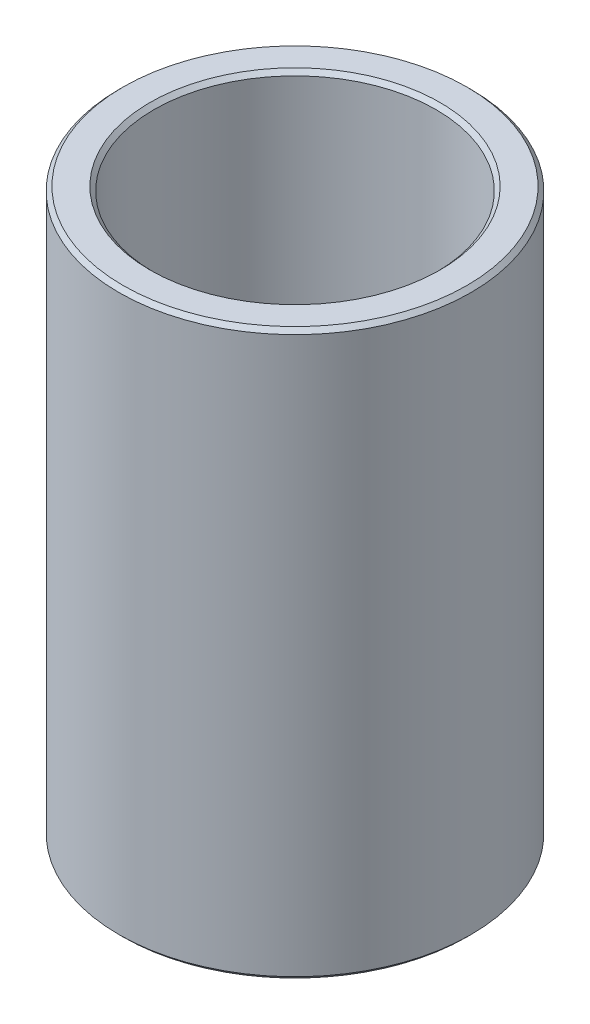
ISO-10303-21;
HEADER;
FILE_DESCRIPTION(('STEP AP214'),'2;1');
FILE_NAME('part.step','',(''),(''),'','','');
FILE_SCHEMA(('AUTOMOTIVE_DESIGN { 1 0 10303 214 1 1 1 1 }'));
ENDSEC;
DATA;
#1=APPLICATION_CONTEXT('core data for automotive mechanical design processes');
#2=APPLICATION_PROTOCOL_DEFINITION('international standard','automotive_design',2000,#1);
#3=PRODUCT_CONTEXT('',#1,'mechanical');
#4=PRODUCT('Part','Part','',(#3));
#5=PRODUCT_RELATED_PRODUCT_CATEGORY('part','',(#4));
#6=PRODUCT_DEFINITION_FORMATION('','',#4);
#7=PRODUCT_DEFINITION_CONTEXT('part definition',#1,'design');
#8=PRODUCT_DEFINITION('design','',#6,#7);
#9=PRODUCT_DEFINITION_SHAPE('','',#8);
#10=(LENGTH_UNIT() NAMED_UNIT(*) SI_UNIT(.MILLI.,.METRE.));
#11=(NAMED_UNIT(*) PLANE_ANGLE_UNIT() SI_UNIT($,.RADIAN.));
#12=(NAMED_UNIT(*) SI_UNIT($,.STERADIAN.) SOLID_ANGLE_UNIT());
#13=UNCERTAINTY_MEASURE_WITH_UNIT(LENGTH_MEASURE(1.E-05),#10,'distance_accuracy_value','');
#14=(GEOMETRIC_REPRESENTATION_CONTEXT(3) GLOBAL_UNCERTAINTY_ASSIGNED_CONTEXT((#13)) GLOBAL_UNIT_ASSIGNED_CONTEXT((#10,
#11,#12)) REPRESENTATION_CONTEXT('',''));
#15=CARTESIAN_POINT('',(0.,0.,0.));
#16=DIRECTION('',(0.,0.,1.));
#17=DIRECTION('',(1.,0.,0.));
#18=AXIS2_PLACEMENT_3D('',#15,#16,#17);
#19=CARTESIAN_POINT('',(0.,104.1880727642,0.));
#20=DIRECTION('',(0.,-1.,0.));
#21=DIRECTION('',(0.,0.,-1.));
#22=AXIS2_PLACEMENT_3D('',#19,#20,#21);
#23=CYLINDRICAL_SURFACE('',#22,32.5);
#24=CARTESIAN_POINT('',(0.,0.755256746545419,0.));
#25=DIRECTION('',(0.,1.,0.));
#26=DIRECTION('',(0.,0.,1.));
#27=AXIS2_PLACEMENT_3D('',#24,#25,#26);
#28=CIRCLE('',#27,32.5);
#29=CARTESIAN_POINT('',(0.,0.755256746545419,-32.5));
#30=VERTEX_POINT('',#29);
#31=EDGE_CURVE('E10',#30,#30,#28,.T.);
#32=CARTESIAN_POINT('',(0.,103.432816017654,0.));
#33=DIRECTION('',(0.,1.,0.));
#34=DIRECTION('',(0.,0.,1.));
#35=AXIS2_PLACEMENT_3D('',#32,#33,#34);
#36=CIRCLE('',#35,32.5);
#37=CARTESIAN_POINT('',(0.,103.432816017654,-32.5));
#38=VERTEX_POINT('',#37);
#39=EDGE_CURVE('E50',#38,#38,#36,.F.);
#40=CARTESIAN_POINT('',(0.,0.755256746545419,-32.5));
#41=CARTESIAN_POINT('',(0.,1.82481465561947,-32.5));
#42=CARTESIAN_POINT('',(0.,2.89437256469352,-32.5));
#43=CARTESIAN_POINT('',(0.,5.03348838284162,-32.5));
#44=CARTESIAN_POINT('',(0.,6.10304629191567,-32.5));
#45=CARTESIAN_POINT('',(0.,8.24216211006378,-32.5));
#46=CARTESIAN_POINT('',(0.,9.31172001913783,-32.5));
#47=CARTESIAN_POINT('',(0.,11.4508358372859,-32.5));
#48=CARTESIAN_POINT('',(0.,12.52039374636,-32.5));
#49=CARTESIAN_POINT('',(0.,14.6595095645081,-32.5));
#50=CARTESIAN_POINT('',(0.,15.7290674735821,-32.5));
#51=CARTESIAN_POINT('',(0.,17.8681832917302,-32.5));
#52=CARTESIAN_POINT('',(0.,18.9377412008043,-32.5));
#53=CARTESIAN_POINT('',(0.,21.0768570189524,-32.5));
#54=CARTESIAN_POINT('',(0.,22.1464149280264,-32.5));
#55=CARTESIAN_POINT('',(0.,24.2855307461745,-32.5));
#56=CARTESIAN_POINT('',(0.,25.3550886552486,-32.5));
#57=CARTESIAN_POINT('',(0.,27.4942044733967,-32.5));
#58=CARTESIAN_POINT('',(0.,28.5637623824707,-32.5));
#59=CARTESIAN_POINT('',(0.,30.7028782006188,-32.5));
#60=CARTESIAN_POINT('',(0.,31.7724361096929,-32.5));
#61=CARTESIAN_POINT('',(0.,33.911551927841,-32.5));
#62=CARTESIAN_POINT('',(0.,34.981109836915,-32.5));
#63=CARTESIAN_POINT('',(0.,37.1202256550631,-32.5));
#64=CARTESIAN_POINT('',(0.,38.1897835641372,-32.5));
#65=CARTESIAN_POINT('',(0.,40.3288993822853,-32.5));
#66=CARTESIAN_POINT('',(0.,41.3984572913593,-32.5));
#67=CARTESIAN_POINT('',(0.,43.5375731095074,-32.5));
#68=CARTESIAN_POINT('',(0.,44.6071310185815,-32.5));
#69=CARTESIAN_POINT('',(0.,46.7462468367296,-32.5));
#70=CARTESIAN_POINT('',(0.,47.8158047458036,-32.5));
#71=CARTESIAN_POINT('',(0.,49.9549205639517,-32.5));
#72=CARTESIAN_POINT('',(0.,51.0244784730258,-32.5));
#73=CARTESIAN_POINT('',(0.,53.1635942911739,-32.5));
#74=CARTESIAN_POINT('',(0.,54.2331522002479,-32.5));
#75=CARTESIAN_POINT('',(0.,56.372268018396,-32.5));
#76=CARTESIAN_POINT('',(0.,57.4418259274701,-32.5));
#77=CARTESIAN_POINT('',(0.,59.5809417456182,-32.5));
#78=CARTESIAN_POINT('',(0.,60.6504996546922,-32.5));
#79=CARTESIAN_POINT('',(0.,62.7896154728403,-32.5));
#80=CARTESIAN_POINT('',(0.,63.8591733819144,-32.5));
#81=CARTESIAN_POINT('',(0.,65.9982892000625,-32.5));
#82=CARTESIAN_POINT('',(0.,67.0678471091365,-32.5));
#83=CARTESIAN_POINT('',(0.,69.2069629272846,-32.5));
#84=CARTESIAN_POINT('',(0.,70.2765208363587,-32.5));
#85=CARTESIAN_POINT('',(0.,72.4156366545068,-32.5));
#86=CARTESIAN_POINT('',(0.,73.4851945635808,-32.5));
#87=CARTESIAN_POINT('',(0.,75.6243103817289,-32.5));
#88=CARTESIAN_POINT('',(0.,76.693868290803,-32.5));
#89=CARTESIAN_POINT('',(0.,78.8329841089511,-32.5));
#90=CARTESIAN_POINT('',(0.,79.9025420180251,-32.5));
#91=CARTESIAN_POINT('',(0.,82.0416578361732,-32.5));
#92=CARTESIAN_POINT('',(0.,83.1112157452473,-32.5));
#93=CARTESIAN_POINT('',(0.,85.2503315633954,-32.5));
#94=CARTESIAN_POINT('',(0.,86.3198894724695,-32.5));
#95=CARTESIAN_POINT('',(0.,88.4590052906176,-32.5));
#96=CARTESIAN_POINT('',(0.,89.5285631996916,-32.5));
#97=CARTESIAN_POINT('',(0.,91.6676790178397,-32.5));
#98=CARTESIAN_POINT('',(0.,92.7372369269137,-32.5));
#99=CARTESIAN_POINT('',(0.,94.8763527450618,-32.5));
#100=CARTESIAN_POINT('',(0.,95.9459106541359,-32.5));
#101=CARTESIAN_POINT('',(0.,98.085026472284,-32.5));
#102=CARTESIAN_POINT('',(0.,99.154584381358,-32.5));
#103=CARTESIAN_POINT('',(0.,101.293700199506,-32.5));
#104=CARTESIAN_POINT('',(0.,102.36325810858,-32.5));
#105=CARTESIAN_POINT('',(0.,103.432816017654,-32.5));
#106=B_SPLINE_CURVE_WITH_KNOTS('',3,(#40,#41,#42,#43,#44,#45,#46,#47,#48,#49,#50,#51,#52,#53,
#54,#55,#56,#57,#58,#59,#60,#61,#62,#63,#64,#65,#66,#67,#68,#69,#70,#71,#72,#73,#74,#75,#76,#77,
#78,#79,#80,#81,#82,#83,#84,#85,#86,#87,#88,#89,#90,#91,#92,#93,#94,#95,#96,#97,#98,#99,#100,
#101,#102,#103,#104,#105),.UNSPECIFIED.,.F.,.F.,(4,2,2,2,2,2,2,2,2,2,2,2,2,2,2,2,2,2,2,2,2,2,2,
2,2,2,2,2,2,2,2,2,4),(0.,3.20867372722215,6.41734745444431,9.62602118166646,12.8346949088886,
16.0433686361107,19.2520423633329,22.4607160905551,25.6693898177772,28.8780635449994,
32.0867372722215,35.2954109994437,38.5040847266658,41.712758453888,44.9214321811101,
48.1301059083323,51.3387796355544,54.5474533627766,57.7561270899987,60.9648008172209,
64.173474544443,67.3821482716652,70.5908219988873,73.7994957261095,77.0081694533316,
80.2168431805538,83.4255169077759,86.6341906349981,89.8428643622202,93.0515380894424,
96.2602118166645,99.4688855438867,102.677559271109),.UNSPECIFIED.);
#107=EDGE_CURVE('BSEAM39',#30,#38,#106,.T.);
#108=ORIENTED_EDGE('',*,*,#31,.T.);
#109=ORIENTED_EDGE('',*,*,#39,.T.);
#110=ORIENTED_EDGE('',*,*,#107,.T.);
#111=ORIENTED_EDGE('',*,*,#107,.F.);
#112=EDGE_LOOP('',(#108,#110,#109,#111));
#113=FACE_BOUND('',#112,.T.);
#114=ADVANCED_FACE('F39',(#113),#23,.T.);
#115=CARTESIAN_POINT('',(0.,104.1880727642,0.));
#116=DIRECTION('',(0.,1.,0.));
#117=DIRECTION('',(0.,0.,1.));
#118=AXIS2_PLACEMENT_3D('',#115,#116,#117);
#119=PLANE('',#118);
#120=CARTESIAN_POINT('',(0.,104.1880727642,0.));
#121=DIRECTION('',(0.,1.,0.));
#122=DIRECTION('',(0.,0.,1.));
#123=AXIS2_PLACEMENT_3D('',#120,#121,#122);
#124=CIRCLE('',#123,26.7918937358219);
#125=CARTESIAN_POINT('',(0.,104.1880727642,26.7918937358219));
#126=VERTEX_POINT('',#125);
#127=EDGE_CURVE('E58',#126,#126,#124,.F.);
#128=ORIENTED_EDGE('',*,*,#127,.T.);
#129=EDGE_LOOP('',(#128));
#130=FACE_BOUND('',#129,.T.);
#131=CARTESIAN_POINT('',(0.,104.1880727642,0.));
#132=DIRECTION('',(0.,1.,0.));
#133=DIRECTION('',(0.,0.,1.));
#134=AXIS2_PLACEMENT_3D('',#131,#132,#133);
#135=CIRCLE('',#134,31.7447432534545);
#136=CARTESIAN_POINT('',(0.,104.1880727642,-31.7447432534545));
#137=VERTEX_POINT('',#136);
#138=EDGE_CURVE('E61',#137,#137,#135,.T.);
#139=ORIENTED_EDGE('',*,*,#138,.T.);
#140=EDGE_LOOP('',(#139));
#141=FACE_BOUND('',#140,.T.);
#142=ADVANCED_FACE('F88',(#130,#141),#119,.T.);
#143=CARTESIAN_POINT('',(0.,0.,0.));
#144=DIRECTION('',(0.,1.,0.));
#145=DIRECTION('',(0.,0.,1.));
#146=AXIS2_PLACEMENT_3D('',#143,#144,#145);
#147=PLANE('',#146);
#148=CARTESIAN_POINT('',(0.,0.,0.));
#149=DIRECTION('',(0.,1.,0.));
#150=DIRECTION('',(0.,0.,1.));
#151=AXIS2_PLACEMENT_3D('',#148,#149,#150);
#152=CIRCLE('',#151,26.7918937358219);
#153=CARTESIAN_POINT('',(0.,0.,-26.7918937358219));
#154=VERTEX_POINT('',#153);
#155=EDGE_CURVE('E51',#154,#154,#152,.T.);
#156=ORIENTED_EDGE('',*,*,#155,.T.);
#157=EDGE_LOOP('',(#156));
#158=FACE_BOUND('',#157,.T.);
#159=CARTESIAN_POINT('',(0.,0.,0.));
#160=DIRECTION('',(0.,1.,0.));
#161=DIRECTION('',(0.,0.,1.));
#162=AXIS2_PLACEMENT_3D('',#159,#160,#161);
#163=CIRCLE('',#162,31.7447432534546);
#164=CARTESIAN_POINT('',(0.,0.,31.7447432534546));
#165=VERTEX_POINT('',#164);
#166=EDGE_CURVE('E54',#165,#165,#163,.F.);
#167=ORIENTED_EDGE('',*,*,#166,.T.);
#168=EDGE_LOOP('',(#167));
#169=FACE_BOUND('',#168,.T.);
#170=ADVANCED_FACE('F83',(#158,#169),#147,.F.);
#171=CARTESIAN_POINT('',(0.,104.1880727642,0.));
#172=DIRECTION('',(0.,-1.,0.));
#173=DIRECTION('',(0.,0.,-1.));
#174=AXIS2_PLACEMENT_3D('',#171,#172,#173);
#175=CYLINDRICAL_SURFACE('',#174,26.0366369892765);
#176=CARTESIAN_POINT('',(0.,103.432816017654,0.));
#177=DIRECTION('',(0.,1.,0.));
#178=DIRECTION('',(0.,0.,1.));
#179=AXIS2_PLACEMENT_3D('',#176,#177,#178);
#180=CIRCLE('',#179,26.0366369892765);
#181=CARTESIAN_POINT('',(0.,103.432816017654,-26.0366369892765));
#182=VERTEX_POINT('',#181);
#183=EDGE_CURVE('E67',#182,#182,#180,.T.);
#184=CARTESIAN_POINT('',(0.,0.755256746545432,0.));
#185=DIRECTION('',(0.,1.,0.));
#186=DIRECTION('',(0.,0.,1.));
#187=AXIS2_PLACEMENT_3D('',#184,#185,#186);
#188=CIRCLE('',#187,26.0366369892765);
#189=CARTESIAN_POINT('',(0.,0.755256746545419,-26.0366369892765));
#190=VERTEX_POINT('',#189);
#191=EDGE_CURVE('E69',#190,#190,#188,.F.);
#192=CARTESIAN_POINT('',(0.,103.432816017654,-26.0366369892765));
#193=CARTESIAN_POINT('',(0.,102.36325810858,-26.0366369892765));
#194=CARTESIAN_POINT('',(0.,101.293700199506,-26.0366369892765));
#195=CARTESIAN_POINT('',(0.,99.1545843813581,-26.0366369892765));
#196=CARTESIAN_POINT('',(0.,98.0850264722841,-26.0366369892765));
#197=CARTESIAN_POINT('',(0.,95.945910654136,-26.0366369892765));
#198=CARTESIAN_POINT('',(0.,94.8763527450619,-26.0366369892765));
#199=CARTESIAN_POINT('',(0.,92.7372369269138,-26.0366369892765));
#200=CARTESIAN_POINT('',(0.,91.6676790178398,-26.0366369892765));
#201=CARTESIAN_POINT('',(0.,89.5285631996917,-26.0366369892765));
#202=CARTESIAN_POINT('',(0.,88.4590052906176,-26.0366369892765));
#203=CARTESIAN_POINT('',(0.,86.3198894724695,-26.0366369892765));
#204=CARTESIAN_POINT('',(0.,85.2503315633955,-26.0366369892765));
#205=CARTESIAN_POINT('',(0.,83.1112157452474,-26.0366369892765));
#206=CARTESIAN_POINT('',(0.,82.0416578361733,-26.0366369892765));
#207=CARTESIAN_POINT('',(0.,79.9025420180252,-26.0366369892765));
#208=CARTESIAN_POINT('',(0.,78.8329841089512,-26.0366369892765));
#209=CARTESIAN_POINT('',(0.,76.6938682908031,-26.0366369892765));
#210=CARTESIAN_POINT('',(0.,75.624310381729,-26.0366369892765));
#211=CARTESIAN_POINT('',(0.,73.4851945635809,-26.0366369892765));
#212=CARTESIAN_POINT('',(0.,72.4156366545069,-26.0366369892765));
#213=CARTESIAN_POINT('',(0.,70.2765208363588,-26.0366369892765));
#214=CARTESIAN_POINT('',(0.,69.2069629272847,-26.0366369892765));
#215=CARTESIAN_POINT('',(0.,67.0678471091366,-26.0366369892765));
#216=CARTESIAN_POINT('',(0.,65.9982892000626,-26.0366369892765));
#217=CARTESIAN_POINT('',(0.,63.8591733819145,-26.0366369892765));
#218=CARTESIAN_POINT('',(0.,62.7896154728404,-26.0366369892765));
#219=CARTESIAN_POINT('',(0.,60.6504996546923,-26.0366369892765));
#220=CARTESIAN_POINT('',(0.,59.5809417456182,-26.0366369892765));
#221=CARTESIAN_POINT('',(0.,57.4418259274701,-26.0366369892765));
#222=CARTESIAN_POINT('',(0.,56.3722680183961,-26.0366369892765));
#223=CARTESIAN_POINT('',(0.,54.233152200248,-26.0366369892765));
#224=CARTESIAN_POINT('',(0.,53.1635942911739,-26.0366369892765));
#225=CARTESIAN_POINT('',(0.,51.0244784730258,-26.0366369892765));
#226=CARTESIAN_POINT('',(0.,49.9549205639518,-26.0366369892765));
#227=CARTESIAN_POINT('',(0.,47.8158047458037,-26.0366369892765));
#228=CARTESIAN_POINT('',(0.,46.7462468367296,-26.0366369892765));
#229=CARTESIAN_POINT('',(0.,44.6071310185815,-26.0366369892765));
#230=CARTESIAN_POINT('',(0.,43.5375731095075,-26.0366369892765));
#231=CARTESIAN_POINT('',(0.,41.3984572913594,-26.0366369892765));
#232=CARTESIAN_POINT('',(0.,40.3288993822853,-26.0366369892765));
#233=CARTESIAN_POINT('',(0.,38.1897835641372,-26.0366369892765));
#234=CARTESIAN_POINT('',(0.,37.1202256550632,-26.0366369892765));
#235=CARTESIAN_POINT('',(0.,34.9811098369151,-26.0366369892765));
#236=CARTESIAN_POINT('',(0.,33.911551927841,-26.0366369892765));
#237=CARTESIAN_POINT('',(0.,31.7724361096929,-26.0366369892765));
#238=CARTESIAN_POINT('',(0.,30.7028782006189,-26.0366369892765));
#239=CARTESIAN_POINT('',(0.,28.5637623824708,-26.0366369892765));
#240=CARTESIAN_POINT('',(0.,27.4942044733967,-26.0366369892765));
#241=CARTESIAN_POINT('',(0.,25.3550886552486,-26.0366369892765));
#242=CARTESIAN_POINT('',(0.,24.2855307461745,-26.0366369892765));
#243=CARTESIAN_POINT('',(0.,22.1464149280264,-26.0366369892765));
#244=CARTESIAN_POINT('',(0.,21.0768570189524,-26.0366369892765));
#245=CARTESIAN_POINT('',(0.,18.9377412008043,-26.0366369892765));
#246=CARTESIAN_POINT('',(0.,17.8681832917302,-26.0366369892765));
#247=CARTESIAN_POINT('',(0.,15.7290674735821,-26.0366369892765));
#248=CARTESIAN_POINT('',(0.,14.6595095645081,-26.0366369892765));
#249=CARTESIAN_POINT('',(0.,12.52039374636,-26.0366369892765));
#250=CARTESIAN_POINT('',(0.,11.4508358372859,-26.0366369892765));
#251=CARTESIAN_POINT('',(0.,9.31172001913783,-26.0366369892765));
#252=CARTESIAN_POINT('',(0.,8.24216211006378,-26.0366369892765));
#253=CARTESIAN_POINT('',(0.,6.10304629191568,-26.0366369892765));
#254=CARTESIAN_POINT('',(0.,5.03348838284163,-26.0366369892765));
#255=CARTESIAN_POINT('',(0.,2.89437256469353,-26.0366369892765));
#256=CARTESIAN_POINT('',(0.,1.82481465561947,-26.0366369892765));
#257=CARTESIAN_POINT('',(0.,0.755256746545419,-26.0366369892765));
#258=B_SPLINE_CURVE_WITH_KNOTS('',3,(#192,#193,#194,#195,#196,#197,#198,#199,#200,#201,#202,
#203,#204,#205,#206,#207,#208,#209,#210,#211,#212,#213,#214,#215,#216,#217,#218,#219,#220,#221,
#222,#223,#224,#225,#226,#227,#228,#229,#230,#231,#232,#233,#234,#235,#236,#237,#238,#239,#240,
#241,#242,#243,#244,#245,#246,#247,#248,#249,#250,#251,#252,#253,#254,#255,#256,#257),
.UNSPECIFIED.,.F.,.F.,(4,2,2,2,2,2,2,2,2,2,2,2,2,2,2,2,2,2,2,2,2,2,2,2,2,2,2,2,2,2,2,2,4),(0.,
3.20867372722215,6.41734745444431,9.62602118166646,12.8346949088886,16.0433686361108,
19.2520423633329,22.4607160905551,25.6693898177772,28.8780635449994,32.0867372722215,
35.2954109994437,38.5040847266658,41.712758453888,44.9214321811101,48.1301059083323,
51.3387796355545,54.5474533627766,57.7561270899988,60.9648008172209,64.1734745444431,
67.3821482716652,70.5908219988874,73.7994957261095,77.0081694533317,80.2168431805538,
83.425516907776,86.6341906349981,89.8428643622203,93.0515380894424,96.2602118166646,
99.4688855438867,102.677559271109),.UNSPECIFIED.);
#259=EDGE_CURVE('BSEAM71',#182,#190,#258,.T.);
#260=ORIENTED_EDGE('',*,*,#183,.T.);
#261=ORIENTED_EDGE('',*,*,#191,.T.);
#262=ORIENTED_EDGE('',*,*,#259,.T.);
#263=ORIENTED_EDGE('',*,*,#259,.F.);
#264=EDGE_LOOP('',(#260,#262,#261,#263));
#265=FACE_BOUND('',#264,.T.);
#266=ADVANCED_FACE('F71',(#265),#175,.F.);
#267=CARTESIAN_POINT('',(0.,103.432816017654,0.));
#268=DIRECTION('',(0.,1.,0.));
#269=DIRECTION('',(0.,0.,1.));
#270=AXIS2_PLACEMENT_3D('',#267,#268,#269);
#271=CONICAL_SURFACE('',#270,26.0366369892765,0.785398163397451);
#272=ORIENTED_EDGE('',*,*,#127,.F.);
#273=EDGE_LOOP('',(#272));
#274=FACE_BOUND('',#273,.T.);
#275=ORIENTED_EDGE('',*,*,#183,.F.);
#276=EDGE_LOOP('',(#275));
#277=FACE_BOUND('',#276,.T.);
#278=ADVANCED_FACE('F77',(#274,#277),#271,.F.);
#279=CARTESIAN_POINT('',(0.,0.,0.));
#280=DIRECTION('',(0.,-1.,0.));
#281=DIRECTION('',(0.,0.,-1.));
#282=AXIS2_PLACEMENT_3D('',#279,#280,#281);
#283=CONICAL_SURFACE('',#282,26.7918937358219,0.785398163397441);
#284=CARTESIAN_POINT('',(0.,0.755256746545432,-26.0366369892765));
#285=CARTESIAN_POINT('',(0.,0.747389488768917,-26.044504247053));
#286=CARTESIAN_POINT('',(0.,0.739522230992402,-26.0523715048295));
#287=CARTESIAN_POINT('',(0.,0.723787715439373,-26.0681060203825));
#288=CARTESIAN_POINT('',(0.,0.715920457662858,-26.075973278159));
#289=CARTESIAN_POINT('',(0.,0.700185942109828,-26.0917077937121));
#290=CARTESIAN_POINT('',(0.,0.692318684333313,-26.0995750514886));
#291=CARTESIAN_POINT('',(0.,0.676584168780283,-26.1153095670416));
#292=CARTESIAN_POINT('',(0.,0.668716911003768,-26.1231768248181));
#293=CARTESIAN_POINT('',(0.,0.652982395450738,-26.1389113403711));
#294=CARTESIAN_POINT('',(0.,0.645115137674223,-26.1467785981477));
#295=CARTESIAN_POINT('',(0.,0.629380622121194,-26.1625131137007));
#296=CARTESIAN_POINT('',(0.,0.621513364344679,-26.1703803714772));
#297=CARTESIAN_POINT('',(0.,0.605778848791649,-26.1861148870302));
#298=CARTESIAN_POINT('',(0.,0.597911591015134,-26.1939821448067));
#299=CARTESIAN_POINT('',(0.,0.582177075462104,-26.2097166603598));
#300=CARTESIAN_POINT('',(0.,0.574309817685589,-26.2175839181363));
#301=CARTESIAN_POINT('',(0.,0.558575302132559,-26.2333184336893));
#302=CARTESIAN_POINT('',(0.,0.550708044356044,-26.2411856914658));
#303=CARTESIAN_POINT('',(0.,0.534973528803015,-26.2569202070189));
#304=CARTESIAN_POINT('',(0.,0.5271062710265,-26.2647874647954));
#305=CARTESIAN_POINT('',(0.,0.51137175547347,-26.2805219803484));
#306=CARTESIAN_POINT('',(0.,0.503504497696955,-26.2883892381249));
#307=CARTESIAN_POINT('',(0.,0.487769982143925,-26.304123753678));
#308=CARTESIAN_POINT('',(0.,0.47990272436741,-26.3119910114545));
#309=CARTESIAN_POINT('',(0.,0.46416820881438,-26.3277255270075));
#310=CARTESIAN_POINT('',(0.,0.456300951037865,-26.335592784784));
#311=CARTESIAN_POINT('',(0.,0.440566435484836,-26.351327300337));
#312=CARTESIAN_POINT('',(0.,0.432699177708321,-26.3591945581136));
#313=CARTESIAN_POINT('',(0.,0.416964662155291,-26.3749290736666));
#314=CARTESIAN_POINT('',(0.,0.409097404378775,-26.3827963314431));
#315=CARTESIAN_POINT('',(0.,0.393362888825746,-26.3985308469961));
#316=CARTESIAN_POINT('',(0.,0.385495631049231,-26.4063981047726));
#317=CARTESIAN_POINT('',(0.,0.369761115496202,-26.4221326203257));
#318=CARTESIAN_POINT('',(0.,0.361893857719686,-26.4299998781022));
#319=CARTESIAN_POINT('',(0.,0.346159342166656,-26.4457343936552));
#320=CARTESIAN_POINT('',(0.,0.338292084390141,-26.4536016514317));
#321=CARTESIAN_POINT('',(0.,0.322557568837112,-26.4693361669848));
#322=CARTESIAN_POINT('',(0.,0.314690311060597,-26.4772034247613));
#323=CARTESIAN_POINT('',(0.,0.298955795507567,-26.4929379403143));
#324=CARTESIAN_POINT('',(0.,0.291088537731052,-26.5008051980908));
#325=CARTESIAN_POINT('',(0.,0.275354022178022,-26.5165397136439));
#326=CARTESIAN_POINT('',(0.,0.267486764401507,-26.5244069714204));
#327=CARTESIAN_POINT('',(0.,0.251752248848477,-26.5401414869734));
#328=CARTESIAN_POINT('',(0.,0.243884991071963,-26.5480087447499));
#329=CARTESIAN_POINT('',(0.,0.228150475518933,-26.5637432603029));
#330=CARTESIAN_POINT('',(0.,0.220283217742418,-26.5716105180795));
#331=CARTESIAN_POINT('',(0.,0.204548702189388,-26.5873450336325));
#332=CARTESIAN_POINT('',(0.,0.196681444412873,-26.595212291409));
#333=CARTESIAN_POINT('',(0.,0.180946928859843,-26.610946806962));
#334=CARTESIAN_POINT('',(0.,0.173079671083328,-26.6188140647385));
#335=CARTESIAN_POINT('',(0.,0.157345155530298,-26.6345485802916));
#336=CARTESIAN_POINT('',(0.,0.149477897753783,-26.6424158380681));
#337=CARTESIAN_POINT('',(0.,0.133743382200754,-26.6581503536211));
#338=CARTESIAN_POINT('',(0.,0.125876124424239,-26.6660176113976));
#339=CARTESIAN_POINT('',(0.,0.110141608871209,-26.6817521269507));
#340=CARTESIAN_POINT('',(0.,0.102274351094694,-26.6896193847272));
#341=CARTESIAN_POINT('',(0.,0.0865398355416641,-26.7053539002802));
#342=CARTESIAN_POINT('',(0.,0.0786725777651492,-26.7132211580567));
#343=CARTESIAN_POINT('',(0.,0.0629380622121194,-26.7289556736098));
#344=CARTESIAN_POINT('',(0.,0.0550708044356044,-26.7368229313863));
#345=CARTESIAN_POINT('',(0.,0.0393362888825746,-26.7525574469393));
#346=CARTESIAN_POINT('',(0.,0.0314690311060597,-26.7604247047158));
#347=CARTESIAN_POINT('',(0.,0.0157345155530298,-26.7761592202688));
#348=CARTESIAN_POINT('',(0.,0.00786725777651493,-26.7840264780454));
#349=CARTESIAN_POINT('',(0.,0.,-26.7918937358219));
#350=B_SPLINE_CURVE_WITH_KNOTS('',3,(#284,#285,#286,#287,#288,#289,#290,#291,#292,#293,#294,
#295,#296,#297,#298,#299,#300,#301,#302,#303,#304,#305,#306,#307,#308,#309,#310,#311,#312,#313,
#314,#315,#316,#317,#318,#319,#320,#321,#322,#323,#324,#325,#326,#327,#328,#329,#330,#331,#332,
#333,#334,#335,#336,#337,#338,#339,#340,#341,#342,#343,#344,#345,#346,#347,#348,#349),
.UNSPECIFIED.,.F.,.F.,(4,2,2,2,2,2,2,2,2,2,2,2,2,2,2,2,2,2,2,2,2,2,2,2,2,2,2,2,2,2,2,2,4),(0.,
0.0333779479386975,0.066755895877395,0.100133843816092,0.13351179175479,0.166889739693487,
0.200267687632185,0.233645635570882,0.26702358350958,0.300401531448277,0.333779479386975,
0.367157427325672,0.40053537526437,0.433913323203067,0.467291271141765,0.500669219080462,
0.534047167019162,0.56742511495786,0.600803062896557,0.634181010835255,0.667558958773952,
0.70093690671265,0.734314854651347,0.767692802590045,0.801070750528742,0.83444869846744,
0.867826646406137,0.901204594344835,0.934582542283532,0.96796049022223,1.00133843816093,
1.03471638609962,1.06809433403832),.UNSPECIFIED.);
#351=EDGE_CURVE('BSEAM73',#190,#154,#350,.T.);
#352=ORIENTED_EDGE('',*,*,#191,.F.);
#353=ORIENTED_EDGE('',*,*,#155,.F.);
#354=ORIENTED_EDGE('',*,*,#351,.T.);
#355=ORIENTED_EDGE('',*,*,#351,.F.);
#356=EDGE_LOOP('',(#352,#354,#353,#355));
#357=FACE_BOUND('',#356,.T.);
#358=ADVANCED_FACE('F73',(#357),#283,.F.);
#359=CARTESIAN_POINT('',(0.,0.755256746545419,0.));
#360=DIRECTION('',(0.,1.,0.));
#361=DIRECTION('',(0.,0.,1.));
#362=AXIS2_PLACEMENT_3D('',#359,#360,#361);
#363=CONICAL_SURFACE('',#362,32.5,0.785398163397457);
#364=ORIENTED_EDGE('',*,*,#166,.F.);
#365=EDGE_LOOP('',(#364));
#366=FACE_BOUND('',#365,.T.);
#367=ORIENTED_EDGE('',*,*,#31,.F.);
#368=EDGE_LOOP('',(#367));
#369=FACE_BOUND('',#368,.T.);
#370=ADVANCED_FACE('F76',(#366,#369),#363,.T.);
#371=CARTESIAN_POINT('',(0.,104.1880727642,0.));
#372=DIRECTION('',(0.,-1.,0.));
#373=DIRECTION('',(0.,0.,-1.));
#374=AXIS2_PLACEMENT_3D('',#371,#372,#373);
#375=CONICAL_SURFACE('',#374,31.7447432534545,0.785398163397439);
#376=CARTESIAN_POINT('',(0.,103.432816017654,-32.5));
#377=CARTESIAN_POINT('',(0.,103.440683275431,-32.4921327422235));
#378=CARTESIAN_POINT('',(0.,103.448550533207,-32.484265484447));
#379=CARTESIAN_POINT('',(0.,103.46428504876,-32.4685309688939));
#380=CARTESIAN_POINT('',(0.,103.472152306537,-32.4606637111174));
#381=CARTESIAN_POINT('',(0.,103.48788682209,-32.4449291955644));
#382=CARTESIAN_POINT('',(0.,103.495754079866,-32.4370619377879));
#383=CARTESIAN_POINT('',(0.,103.511488595419,-32.4213274222349));
#384=CARTESIAN_POINT('',(0.,103.519355853196,-32.4134601644583));
#385=CARTESIAN_POINT('',(0.,103.535090368749,-32.3977256489053));
#386=CARTESIAN_POINT('',(0.,103.542957626525,-32.3898583911288));
#387=CARTESIAN_POINT('',(0.,103.558692142079,-32.3741238755758));
#388=CARTESIAN_POINT('',(0.,103.566559399855,-32.3662566177993));
#389=CARTESIAN_POINT('',(0.,103.582293915408,-32.3505221022462));
#390=CARTESIAN_POINT('',(0.,103.590161173185,-32.3426548444697));
#391=CARTESIAN_POINT('',(0.,103.605895688738,-32.3269203289167));
#392=CARTESIAN_POINT('',(0.,103.613762946514,-32.3190530711402));
#393=CARTESIAN_POINT('',(0.,103.629497462067,-32.3033185555871));
#394=CARTESIAN_POINT('',(0.,103.637364719844,-32.2954512978106));
#395=CARTESIAN_POINT('',(0.,103.653099235397,-32.2797167822576));
#396=CARTESIAN_POINT('',(0.,103.660966493173,-32.2718495244811));
#397=CARTESIAN_POINT('',(0.,103.676701008726,-32.256115008928));
#398=CARTESIAN_POINT('',(0.,103.684568266503,-32.2482477511515));
#399=CARTESIAN_POINT('',(0.,103.700302782056,-32.2325132355985));
#400=CARTESIAN_POINT('',(0.,103.708170039832,-32.224645977822));
#401=CARTESIAN_POINT('',(0.,103.723904555385,-32.2089114622689));
#402=CARTESIAN_POINT('',(0.,103.731771813162,-32.2010442044924));
#403=CARTESIAN_POINT('',(0.,103.747506328715,-32.1853096889394));
#404=CARTESIAN_POINT('',(0.,103.755373586491,-32.1774424311629));
#405=CARTESIAN_POINT('',(0.,103.771108102044,-32.1617079156099));
#406=CARTESIAN_POINT('',(0.,103.778975359821,-32.1538406578333));
#407=CARTESIAN_POINT('',(0.,103.794709875374,-32.1381061422803));
#408=CARTESIAN_POINT('',(0.,103.80257713315,-32.1302388845038));
#409=CARTESIAN_POINT('',(0.,103.818311648704,-32.1145043689508));
#410=CARTESIAN_POINT('',(0.,103.82617890648,-32.1066371111742));
#411=CARTESIAN_POINT('',(0.,103.841913422033,-32.0909025956212));
#412=CARTESIAN_POINT('',(0.,103.84978067981,-32.0830353378447));
#413=CARTESIAN_POINT('',(0.,103.865515195363,-32.0673008222917));
#414=CARTESIAN_POINT('',(0.,103.873382453139,-32.0594335645151));
#415=CARTESIAN_POINT('',(0.,103.889116968692,-32.0436990489621));
#416=CARTESIAN_POINT('',(0.,103.896984226469,-32.0358317911856));
#417=CARTESIAN_POINT('',(0.,103.912718742022,-32.0200972756326));
#418=CARTESIAN_POINT('',(0.,103.920585999798,-32.0122300178561));
#419=CARTESIAN_POINT('',(0.,103.936320515351,-31.996495502303));
#420=CARTESIAN_POINT('',(0.,103.944187773128,-31.9886282445265));
#421=CARTESIAN_POINT('',(0.,103.959922288681,-31.9728937289735));
#422=CARTESIAN_POINT('',(0.,103.967789546457,-31.965026471197));
#423=CARTESIAN_POINT('',(0.,103.98352406201,-31.9492919556439));
#424=CARTESIAN_POINT('',(0.,103.991391319787,-31.9414246978674));
#425=CARTESIAN_POINT('',(0.,104.00712583534,-31.9256901823144));
#426=CARTESIAN_POINT('',(0.,104.014993093116,-31.9178229245379));
#427=CARTESIAN_POINT('',(0.,104.030727608669,-31.9020884089848));
#428=CARTESIAN_POINT('',(0.,104.038594866446,-31.8942211512083));
#429=CARTESIAN_POINT('',(0.,104.054329381999,-31.8784866356553));
#430=CARTESIAN_POINT('',(0.,104.062196639775,-31.8706193778788));
#431=CARTESIAN_POINT('',(0.,104.077931155329,-31.8548848623257));
#432=CARTESIAN_POINT('',(0.,104.085798413105,-31.8470176045492));
#433=CARTESIAN_POINT('',(0.,104.101532928658,-31.8312830889962));
#434=CARTESIAN_POINT('',(0.,104.109400186435,-31.8234158312197));
#435=CARTESIAN_POINT('',(0.,104.125134701988,-31.8076813156667));
#436=CARTESIAN_POINT('',(0.,104.133001959764,-31.7998140578901));
#437=CARTESIAN_POINT('',(0.,104.148736475317,-31.7840795423371));
#438=CARTESIAN_POINT('',(0.,104.156603733094,-31.7762122845606));
#439=CARTESIAN_POINT('',(0.,104.172338248647,-31.7604777690076));
#440=CARTESIAN_POINT('',(0.,104.180205506423,-31.7526105112311));
#441=CARTESIAN_POINT('',(0.,104.1880727642,-31.7447432534545));
#442=B_SPLINE_CURVE_WITH_KNOTS('',3,(#376,#377,#378,#379,#380,#381,#382,#383,#384,#385,#386,
#387,#388,#389,#390,#391,#392,#393,#394,#395,#396,#397,#398,#399,#400,#401,#402,#403,#404,#405,
#406,#407,#408,#409,#410,#411,#412,#413,#414,#415,#416,#417,#418,#419,#420,#421,#422,#423,#424,
#425,#426,#427,#428,#429,#430,#431,#432,#433,#434,#435,#436,#437,#438,#439,#440,#441),
.UNSPECIFIED.,.F.,.F.,(4,2,2,2,2,2,2,2,2,2,2,2,2,2,2,2,2,2,2,2,2,2,2,2,2,2,2,2,2,2,2,2,4),(0.,
0.0333779479386923,0.0667558958773993,0.100133843816092,0.133511791754794,0.166889739693496,
0.200267687632188,0.233645635570895,0.267023583509597,0.300401531448289,0.333779479386996,
0.367157427325699,0.400535375264391,0.433913323203093,0.467291271141795,0.500669219080492,
0.534047167019194,0.567425114957896,0.600803062896593,0.634181010835295,0.667558958773998,
0.70093690671269,0.734314854651392,0.767692802590099,0.801070750528791,0.834448698467493,
0.8678266464062,0.901204594344893,0.934582542283595,0.967960490222297,1.00133843816099,
1.0347163860997,1.0680943340384),.UNSPECIFIED.);
#443=EDGE_CURVE('BSEAM45',#38,#137,#442,.T.);
#444=ORIENTED_EDGE('',*,*,#39,.F.);
#445=ORIENTED_EDGE('',*,*,#138,.F.);
#446=ORIENTED_EDGE('',*,*,#443,.T.);
#447=ORIENTED_EDGE('',*,*,#443,.F.);
#448=EDGE_LOOP('',(#444,#446,#445,#447));
#449=FACE_BOUND('',#448,.T.);
#450=ADVANCED_FACE('F45',(#449),#375,.T.);
#451=CLOSED_SHELL('',(#114,#142,#170,#266,#278,#358,#370,#450));
#452=MANIFOLD_SOLID_BREP('B2',#451);
#453=ADVANCED_BREP_SHAPE_REPRESENTATION('',(#18,#452),#14);
#454=SHAPE_DEFINITION_REPRESENTATION(#9,#453);
ENDSEC;
END-ISO-10303-21;
